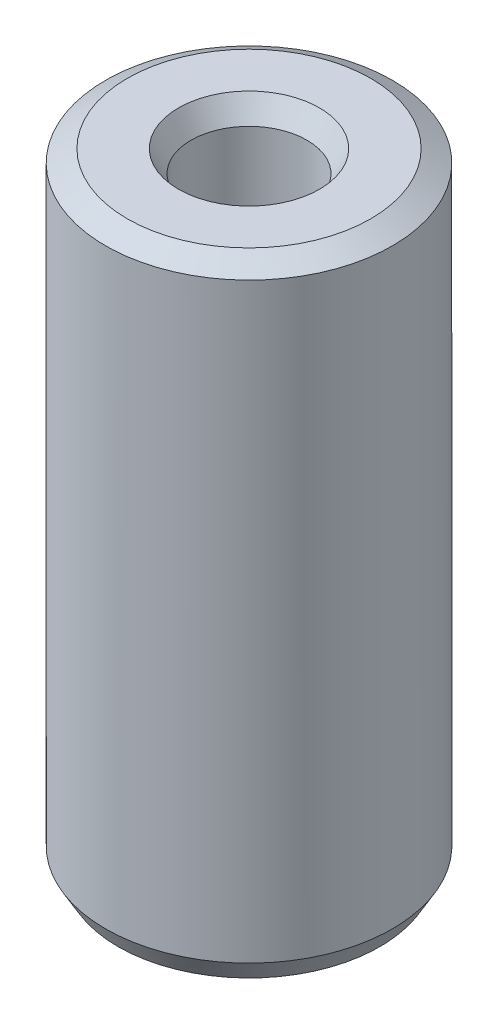
ISO-10303-21;
HEADER;
FILE_DESCRIPTION(('STEP AP214'),'2;1');
FILE_NAME('part.step','',(''),(''),'','','');
FILE_SCHEMA(('AUTOMOTIVE_DESIGN { 1 0 10303 214 1 1 1 1 }'));
ENDSEC;
DATA;
#1=APPLICATION_CONTEXT('core data for automotive mechanical design processes');
#2=APPLICATION_PROTOCOL_DEFINITION('international standard','automotive_design',2000,#1);
#3=PRODUCT_CONTEXT('',#1,'mechanical');
#4=PRODUCT('Part','Part','',(#3));
#5=PRODUCT_RELATED_PRODUCT_CATEGORY('part','',(#4));
#6=PRODUCT_DEFINITION_FORMATION('','',#4);
#7=PRODUCT_DEFINITION_CONTEXT('part definition',#1,'design');
#8=PRODUCT_DEFINITION('design','',#6,#7);
#9=PRODUCT_DEFINITION_SHAPE('','',#8);
#10=(LENGTH_UNIT() NAMED_UNIT(*) SI_UNIT(.MILLI.,.METRE.));
#11=(NAMED_UNIT(*) PLANE_ANGLE_UNIT() SI_UNIT($,.RADIAN.));
#12=(NAMED_UNIT(*) SI_UNIT($,.STERADIAN.) SOLID_ANGLE_UNIT());
#13=UNCERTAINTY_MEASURE_WITH_UNIT(LENGTH_MEASURE(1.E-05),#10,'distance_accuracy_value','');
#14=(GEOMETRIC_REPRESENTATION_CONTEXT(3) GLOBAL_UNCERTAINTY_ASSIGNED_CONTEXT((#13)) GLOBAL_UNIT_ASSIGNED_CONTEXT((#10,
#11,#12)) REPRESENTATION_CONTEXT('',''));
#15=CARTESIAN_POINT('',(0.,0.,0.));
#16=DIRECTION('',(0.,0.,1.));
#17=DIRECTION('',(1.,0.,0.));
#18=AXIS2_PLACEMENT_3D('',#15,#16,#17);
#19=CARTESIAN_POINT('',(0.,196.344045283178,0.));
#20=DIRECTION('',(0.,-1.,0.));
#21=DIRECTION('',(0.,0.,-1.));
#22=AXIS2_PLACEMENT_3D('',#19,#20,#21);
#23=CYLINDRICAL_SURFACE('',#22,45.);
#24=CARTESIAN_POINT('',(0.,6.81315488864112,0.));
#25=DIRECTION('',(0.,1.,0.));
#26=DIRECTION('',(0.,0.,1.));
#27=AXIS2_PLACEMENT_3D('',#24,#25,#26);
#28=CIRCLE('',#27,45.);
#29=CARTESIAN_POINT('',(0.,6.81315488864112,-45.));
#30=VERTEX_POINT('',#29);
#31=EDGE_CURVE('E10',#30,#30,#28,.T.);
#32=CARTESIAN_POINT('',(0.,192.410468474191,0.));
#33=DIRECTION('',(0.,1.,0.));
#34=DIRECTION('',(0.,0.,1.));
#35=AXIS2_PLACEMENT_3D('',#32,#33,#34);
#36=CIRCLE('',#35,45.);
#37=CARTESIAN_POINT('',(0.,192.410468474191,-45.));
#38=VERTEX_POINT('',#37);
#39=EDGE_CURVE('E50',#38,#38,#36,.F.);
#40=CARTESIAN_POINT('',(0.,6.81315488864112,-45.));
#41=CARTESIAN_POINT('',(0.,8.7464602384906,-45.));
#42=CARTESIAN_POINT('',(0.,10.6797655883401,-45.));
#43=CARTESIAN_POINT('',(0.,14.546376288039,-45.));
#44=CARTESIAN_POINT('',(0.,16.4796816378885,-45.));
#45=CARTESIAN_POINT('',(0.,20.3462923375875,-45.));
#46=CARTESIAN_POINT('',(0.,22.279597687437,-45.));
#47=CARTESIAN_POINT('',(0.,26.1462083871359,-45.));
#48=CARTESIAN_POINT('',(0.,28.0795137369854,-45.));
#49=CARTESIAN_POINT('',(0.,31.9461244366843,-45.));
#50=CARTESIAN_POINT('',(0.,33.8794297865338,-45.));
#51=CARTESIAN_POINT('',(0.,37.7460404862328,-45.));
#52=CARTESIAN_POINT('',(0.,39.6793458360823,-45.));
#53=CARTESIAN_POINT('',(0.,43.5459565357812,-45.));
#54=CARTESIAN_POINT('',(0.,45.4792618856307,-45.));
#55=CARTESIAN_POINT('',(0.,49.3458725853296,-45.));
#56=CARTESIAN_POINT('',(0.,51.2791779351791,-45.));
#57=CARTESIAN_POINT('',(0.,55.1457886348781,-45.));
#58=CARTESIAN_POINT('',(0.,57.0790939847275,-45.));
#59=CARTESIAN_POINT('',(0.,60.9457046844265,-45.));
#60=CARTESIAN_POINT('',(0.,62.879010034276,-45.));
#61=CARTESIAN_POINT('',(0.,66.7456207339749,-45.));
#62=CARTESIAN_POINT('',(0.,68.6789260838244,-45.));
#63=CARTESIAN_POINT('',(0.,72.5455367835234,-45.));
#64=CARTESIAN_POINT('',(0.,74.4788421333729,-45.));
#65=CARTESIAN_POINT('',(0.,78.3454528330718,-45.));
#66=CARTESIAN_POINT('',(0.,80.2787581829213,-45.));
#67=CARTESIAN_POINT('',(0.,84.1453688826202,-45.));
#68=CARTESIAN_POINT('',(0.,86.0786742324697,-45.));
#69=CARTESIAN_POINT('',(0.,89.9452849321687,-45.));
#70=CARTESIAN_POINT('',(0.,91.8785902820181,-45.));
#71=CARTESIAN_POINT('',(0.,95.7452009817171,-45.));
#72=CARTESIAN_POINT('',(0.,97.6785063315666,-45.));
#73=CARTESIAN_POINT('',(0.,101.545117031266,-45.));
#74=CARTESIAN_POINT('',(0.,103.478422381115,-45.));
#75=CARTESIAN_POINT('',(0.,107.345033080814,-45.));
#76=CARTESIAN_POINT('',(0.,109.278338430663,-45.));
#77=CARTESIAN_POINT('',(0.,113.144949130362,-45.));
#78=CARTESIAN_POINT('',(0.,115.078254480212,-45.));
#79=CARTESIAN_POINT('',(0.,118.944865179911,-45.));
#80=CARTESIAN_POINT('',(0.,120.87817052976,-45.));
#81=CARTESIAN_POINT('',(0.,124.744781229459,-45.));
#82=CARTESIAN_POINT('',(0.,126.678086579309,-45.));
#83=CARTESIAN_POINT('',(0.,130.544697279008,-45.));
#84=CARTESIAN_POINT('',(0.,132.478002628857,-45.));
#85=CARTESIAN_POINT('',(0.,136.344613328556,-45.));
#86=CARTESIAN_POINT('',(0.,138.277918678406,-45.));
#87=CARTESIAN_POINT('',(0.,142.144529378105,-45.));
#88=CARTESIAN_POINT('',(0.,144.077834727954,-45.));
#89=CARTESIAN_POINT('',(0.,147.944445427653,-45.));
#90=CARTESIAN_POINT('',(0.,149.877750777502,-45.));
#91=CARTESIAN_POINT('',(0.,153.744361477201,-45.));
#92=CARTESIAN_POINT('',(0.,155.677666827051,-45.));
#93=CARTESIAN_POINT('',(0.,159.54427752675,-45.));
#94=CARTESIAN_POINT('',(0.,161.477582876599,-45.));
#95=CARTESIAN_POINT('',(0.,165.344193576298,-45.));
#96=CARTESIAN_POINT('',(0.,167.277498926148,-45.));
#97=CARTESIAN_POINT('',(0.,171.144109625847,-45.));
#98=CARTESIAN_POINT('',(0.,173.077414975696,-45.));
#99=CARTESIAN_POINT('',(0.,176.944025675395,-45.));
#100=CARTESIAN_POINT('',(0.,178.877331025245,-45.));
#101=CARTESIAN_POINT('',(0.,182.743941724944,-45.));
#102=CARTESIAN_POINT('',(0.,184.677247074793,-45.));
#103=CARTESIAN_POINT('',(0.,188.543857774492,-45.));
#104=CARTESIAN_POINT('',(0.,190.477163124342,-45.));
#105=CARTESIAN_POINT('',(0.,192.410468474191,-45.));
#106=B_SPLINE_CURVE_WITH_KNOTS('',3,(#40,#41,#42,#43,#44,#45,#46,#47,#48,#49,#50,#51,#52,#53,
#54,#55,#56,#57,#58,#59,#60,#61,#62,#63,#64,#65,#66,#67,#68,#69,#70,#71,#72,#73,#74,#75,#76,#77,
#78,#79,#80,#81,#82,#83,#84,#85,#86,#87,#88,#89,#90,#91,#92,#93,#94,#95,#96,#97,#98,#99,#100,
#101,#102,#103,#104,#105),.UNSPECIFIED.,.F.,.F.,(4,2,2,2,2,2,2,2,2,2,2,2,2,2,2,2,2,2,2,2,2,2,2,
2,2,2,2,2,2,2,2,2,4),(0.,5.79991604954844,11.5998320990969,17.3997481486453,23.1996641981937,
28.9995802477422,34.7994962972906,40.599412346839,46.3993283963875,52.1992444459359,
57.9991604954843,63.7990765450328,69.5989925945812,75.3989086441296,81.1988246936781,
86.9987407432265,92.7986567927749,98.5985728423234,104.398488891872,110.19840494142,
115.998320990969,121.798237040517,127.598153090066,133.398069139614,139.197985189162,
144.997901238711,150.797817288259,156.597733337808,162.397649387356,168.197565436905,
173.997481486453,179.797397536001,185.59731358555),.UNSPECIFIED.);
#107=EDGE_CURVE('BSEAM39',#30,#38,#106,.T.);
#108=ORIENTED_EDGE('',*,*,#31,.T.);
#109=ORIENTED_EDGE('',*,*,#39,.T.);
#110=ORIENTED_EDGE('',*,*,#107,.T.);
#111=ORIENTED_EDGE('',*,*,#107,.F.);
#112=EDGE_LOOP('',(#108,#110,#109,#111));
#113=FACE_BOUND('',#112,.T.);
#114=ADVANCED_FACE('F39',(#113),#23,.T.);
#115=CARTESIAN_POINT('',(0.,196.344045283178,0.));
#116=DIRECTION('',(0.,1.,0.));
#117=DIRECTION('',(0.,0.,1.));
#118=AXIS2_PLACEMENT_3D('',#115,#116,#117);
#119=PLANE('',#118);
#120=CARTESIAN_POINT('',(0.,196.344045283178,0.));
#121=DIRECTION('',(0.,1.,0.));
#122=DIRECTION('',(0.,0.,1.));
#123=AXIS2_PLACEMENT_3D('',#120,#121,#122);
#124=CIRCLE('',#123,22.1260166864115);
#125=CARTESIAN_POINT('',(0.,196.344045283178,22.1260166864115));
#126=VERTEX_POINT('',#125);
#127=EDGE_CURVE('E58',#126,#126,#124,.F.);
#128=ORIENTED_EDGE('',*,*,#127,.T.);
#129=EDGE_LOOP('',(#128));
#130=FACE_BOUND('',#129,.T.);
#131=CARTESIAN_POINT('',(0.,196.344045283178,0.));
#132=DIRECTION('',(0.,1.,0.));
#133=DIRECTION('',(0.,0.,1.));
#134=AXIS2_PLACEMENT_3D('',#131,#132,#133);
#135=CIRCLE('',#134,38.1868451113594);
#136=CARTESIAN_POINT('',(0.,196.344045283178,38.1868451113594));
#137=VERTEX_POINT('',#136);
#138=EDGE_CURVE('E61',#137,#137,#135,.T.);
#139=ORIENTED_EDGE('',*,*,#138,.T.);
#140=EDGE_LOOP('',(#139));
#141=FACE_BOUND('',#140,.T.);
#142=ADVANCED_FACE('F88',(#130,#141),#119,.T.);
#143=CARTESIAN_POINT('',(0.,0.,0.));
#144=DIRECTION('',(0.,1.,0.));
#145=DIRECTION('',(0.,0.,1.));
#146=AXIS2_PLACEMENT_3D('',#143,#144,#145);
#147=PLANE('',#146);
#148=CARTESIAN_POINT('',(0.,0.,0.));
#149=DIRECTION('',(0.,1.,0.));
#150=DIRECTION('',(0.,0.,1.));
#151=AXIS2_PLACEMENT_3D('',#148,#149,#150);
#152=CIRCLE('',#151,25.0055947660646);
#153=CARTESIAN_POINT('',(0.,0.,25.0055947660646));
#154=VERTEX_POINT('',#153);
#155=EDGE_CURVE('E51',#154,#154,#152,.T.);
#156=ORIENTED_EDGE('',*,*,#155,.T.);
#157=EDGE_LOOP('',(#156));
#158=FACE_BOUND('',#157,.T.);
#159=CARTESIAN_POINT('',(0.,0.,0.));
#160=DIRECTION('',(0.,1.,0.));
#161=DIRECTION('',(0.,0.,1.));
#162=AXIS2_PLACEMENT_3D('',#159,#160,#161);
#163=CIRCLE('',#162,41.0664231910124);
#164=CARTESIAN_POINT('',(0.,0.,41.0664231910124));
#165=VERTEX_POINT('',#164);
#166=EDGE_CURVE('E54',#165,#165,#163,.F.);
#167=ORIENTED_EDGE('',*,*,#166,.T.);
#168=EDGE_LOOP('',(#167));
#169=FACE_BOUND('',#168,.T.);
#170=ADVANCED_FACE('F83',(#158,#169),#147,.F.);
#171=CARTESIAN_POINT('',(0.,196.344045283178,0.));
#172=DIRECTION('',(0.,-1.,0.));
#173=DIRECTION('',(0.,0.,-1.));
#174=AXIS2_PLACEMENT_3D('',#171,#172,#173);
#175=CYLINDRICAL_SURFACE('',#174,18.192439877424);
#176=CARTESIAN_POINT('',(0.,189.530890394537,0.));
#177=DIRECTION('',(0.,1.,0.));
#178=DIRECTION('',(0.,0.,1.));
#179=AXIS2_PLACEMENT_3D('',#176,#177,#178);
#180=CIRCLE('',#179,18.192439877424);
#181=CARTESIAN_POINT('',(0.,189.530890394537,-18.192439877424));
#182=VERTEX_POINT('',#181);
#183=EDGE_CURVE('E67',#182,#182,#180,.T.);
#184=CARTESIAN_POINT('',(0.,3.93357680898734,0.));
#185=DIRECTION('',(0.,1.,0.));
#186=DIRECTION('',(0.,0.,1.));
#187=AXIS2_PLACEMENT_3D('',#184,#185,#186);
#188=CIRCLE('',#187,18.192439877424);
#189=CARTESIAN_POINT('',(0.,3.93357680898734,-18.192439877424));
#190=VERTEX_POINT('',#189);
#191=EDGE_CURVE('E69',#190,#190,#188,.F.);
#192=CARTESIAN_POINT('',(0.,189.530890394537,-18.192439877424));
#193=CARTESIAN_POINT('',(0.,187.597585044688,-18.192439877424));
#194=CARTESIAN_POINT('',(0.,185.664279694838,-18.192439877424));
#195=CARTESIAN_POINT('',(0.,181.797668995139,-18.192439877424));
#196=CARTESIAN_POINT('',(0.,179.86436364529,-18.192439877424));
#197=CARTESIAN_POINT('',(0.,175.997752945591,-18.192439877424));
#198=CARTESIAN_POINT('',(0.,174.064447595742,-18.192439877424));
#199=CARTESIAN_POINT('',(0.,170.197836896043,-18.192439877424));
#200=CARTESIAN_POINT('',(0.,168.264531546193,-18.192439877424));
#201=CARTESIAN_POINT('',(0.,164.397920846494,-18.192439877424));
#202=CARTESIAN_POINT('',(0.,162.464615496645,-18.192439877424));
#203=CARTESIAN_POINT('',(0.,158.598004796946,-18.192439877424));
#204=CARTESIAN_POINT('',(0.,156.664699447096,-18.192439877424));
#205=CARTESIAN_POINT('',(0.,152.798088747397,-18.192439877424));
#206=CARTESIAN_POINT('',(0.,150.864783397548,-18.192439877424));
#207=CARTESIAN_POINT('',(0.,146.998172697849,-18.192439877424));
#208=CARTESIAN_POINT('',(0.,145.064867347999,-18.192439877424));
#209=CARTESIAN_POINT('',(0.,141.1982566483,-18.192439877424));
#210=CARTESIAN_POINT('',(0.,139.264951298451,-18.192439877424));
#211=CARTESIAN_POINT('',(0.,135.398340598752,-18.192439877424));
#212=CARTESIAN_POINT('',(0.,133.465035248902,-18.192439877424));
#213=CARTESIAN_POINT('',(0.,129.598424549204,-18.192439877424));
#214=CARTESIAN_POINT('',(0.,127.665119199354,-18.192439877424));
#215=CARTESIAN_POINT('',(0.,123.798508499655,-18.192439877424));
#216=CARTESIAN_POINT('',(0.,121.865203149806,-18.192439877424));
#217=CARTESIAN_POINT('',(0.,117.998592450107,-18.192439877424));
#218=CARTESIAN_POINT('',(0.,116.065287100257,-18.192439877424));
#219=CARTESIAN_POINT('',(0.,112.198676400558,-18.192439877424));
#220=CARTESIAN_POINT('',(0.,110.265371050709,-18.192439877424));
#221=CARTESIAN_POINT('',(0.,106.39876035101,-18.192439877424));
#222=CARTESIAN_POINT('',(0.,104.46545500116,-18.192439877424));
#223=CARTESIAN_POINT('',(0.,100.598844301461,-18.192439877424));
#224=CARTESIAN_POINT('',(0.,98.6655389516118,-18.192439877424));
#225=CARTESIAN_POINT('',(0.,94.7989282519129,-18.192439877424));
#226=CARTESIAN_POINT('',(0.,92.8656229020634,-18.192439877424));
#227=CARTESIAN_POINT('',(0.,88.9990122023644,-18.192439877424));
#228=CARTESIAN_POINT('',(0.,87.065706852515,-18.192439877424));
#229=CARTESIAN_POINT('',(0.,83.199096152816,-18.192439877424));
#230=CARTESIAN_POINT('',(0.,81.2657908029665,-18.192439877424));
#231=CARTESIAN_POINT('',(0.,77.3991801032676,-18.192439877424));
#232=CARTESIAN_POINT('',(0.,75.4658747534181,-18.192439877424));
#233=CARTESIAN_POINT('',(0.,71.5992640537191,-18.192439877424));
#234=CARTESIAN_POINT('',(0.,69.6659587038697,-18.192439877424));
#235=CARTESIAN_POINT('',(0.,65.7993480041707,-18.192439877424));
#236=CARTESIAN_POINT('',(0.,63.8660426543212,-18.192439877424));
#237=CARTESIAN_POINT('',(0.,59.9994319546223,-18.192439877424));
#238=CARTESIAN_POINT('',(0.,58.0661266047728,-18.192439877424));
#239=CARTESIAN_POINT('',(0.,54.1995159050738,-18.192439877424));
#240=CARTESIAN_POINT('',(0.,52.2662105552243,-18.192439877424));
#241=CARTESIAN_POINT('',(0.,48.3995998555254,-18.192439877424));
#242=CARTESIAN_POINT('',(0.,46.4662945056759,-18.192439877424));
#243=CARTESIAN_POINT('',(0.,42.5996838059769,-18.192439877424));
#244=CARTESIAN_POINT('',(0.,40.6663784561274,-18.192439877424));
#245=CARTESIAN_POINT('',(0.,36.7997677564285,-18.192439877424));
#246=CARTESIAN_POINT('',(0.,34.866462406579,-18.192439877424));
#247=CARTESIAN_POINT('',(0.,30.9998517068801,-18.192439877424));
#248=CARTESIAN_POINT('',(0.,29.0665463570306,-18.192439877424));
#249=CARTESIAN_POINT('',(0.,25.1999356573316,-18.192439877424));
#250=CARTESIAN_POINT('',(0.,23.2666303074821,-18.192439877424));
#251=CARTESIAN_POINT('',(0.,19.4000196077832,-18.192439877424));
#252=CARTESIAN_POINT('',(0.,17.4667142579337,-18.192439877424));
#253=CARTESIAN_POINT('',(0.,13.6001035582347,-18.192439877424));
#254=CARTESIAN_POINT('',(0.,11.6667982083853,-18.192439877424));
#255=CARTESIAN_POINT('',(0.,7.8001875086863,-18.192439877424));
#256=CARTESIAN_POINT('',(0.,5.86688215883682,-18.192439877424));
#257=CARTESIAN_POINT('',(0.,3.93357680898734,-18.192439877424));
#258=B_SPLINE_CURVE_WITH_KNOTS('',3,(#192,#193,#194,#195,#196,#197,#198,#199,#200,#201,#202,
#203,#204,#205,#206,#207,#208,#209,#210,#211,#212,#213,#214,#215,#216,#217,#218,#219,#220,#221,
#222,#223,#224,#225,#226,#227,#228,#229,#230,#231,#232,#233,#234,#235,#236,#237,#238,#239,#240,
#241,#242,#243,#244,#245,#246,#247,#248,#249,#250,#251,#252,#253,#254,#255,#256,#257),
.UNSPECIFIED.,.F.,.F.,(4,2,2,2,2,2,2,2,2,2,2,2,2,2,2,2,2,2,2,2,2,2,2,2,2,2,2,2,2,2,2,2,4),(0.,
5.79991604954846,11.5998320990969,17.3997481486453,23.1996641981938,28.9995802477422,
34.7994962972907,40.5994123468391,46.3993283963875,52.199244445936,57.9991604954844,
63.7990765450328,69.5989925945813,75.3989086441297,81.1988246936781,86.9987407432266,
92.798656792775,98.5985728423235,104.398488891872,110.19840494142,115.998320990969,
121.798237040517,127.598153090066,133.398069139614,139.197985189163,144.997901238711,
150.797817288259,156.597733337808,162.397649387356,168.197565436905,173.997481486453,
179.797397536002,185.59731358555),.UNSPECIFIED.);
#259=EDGE_CURVE('BSEAM71',#182,#190,#258,.T.);
#260=ORIENTED_EDGE('',*,*,#183,.T.);
#261=ORIENTED_EDGE('',*,*,#191,.T.);
#262=ORIENTED_EDGE('',*,*,#259,.T.);
#263=ORIENTED_EDGE('',*,*,#259,.F.);
#264=EDGE_LOOP('',(#260,#262,#261,#263));
#265=FACE_BOUND('',#264,.T.);
#266=ADVANCED_FACE('F71',(#265),#175,.F.);
#267=CARTESIAN_POINT('',(0.,189.530890394537,0.));
#268=DIRECTION('',(0.,1.,0.));
#269=DIRECTION('',(0.,0.,1.));
#270=AXIS2_PLACEMENT_3D('',#267,#268,#269);
#271=CONICAL_SURFACE('',#270,18.192439877424,0.5235987755983);
#272=ORIENTED_EDGE('',*,*,#127,.F.);
#273=EDGE_LOOP('',(#272));
#274=FACE_BOUND('',#273,.T.);
#275=ORIENTED_EDGE('',*,*,#183,.F.);
#276=EDGE_LOOP('',(#275));
#277=FACE_BOUND('',#276,.T.);
#278=ADVANCED_FACE('F77',(#274,#277),#271,.F.);
#279=CARTESIAN_POINT('',(0.,0.,0.));
#280=DIRECTION('',(0.,-1.,0.));
#281=DIRECTION('',(0.,0.,-1.));
#282=AXIS2_PLACEMENT_3D('',#279,#280,#281);
#283=CONICAL_SURFACE('',#282,25.0055947660646,1.04719755119659);
#284=ORIENTED_EDGE('',*,*,#191,.F.);
#285=EDGE_LOOP('',(#284));
#286=FACE_BOUND('',#285,.T.);
#287=ORIENTED_EDGE('',*,*,#155,.F.);
#288=EDGE_LOOP('',(#287));
#289=FACE_BOUND('',#288,.T.);
#290=ADVANCED_FACE('F73',(#286,#289),#283,.F.);
#291=CARTESIAN_POINT('',(0.,6.81315488864112,0.));
#292=DIRECTION('',(0.,1.,0.));
#293=DIRECTION('',(0.,0.,1.));
#294=AXIS2_PLACEMENT_3D('',#291,#292,#293);
#295=CONICAL_SURFACE('',#294,45.,0.523598775598303);
#296=ORIENTED_EDGE('',*,*,#166,.F.);
#297=EDGE_LOOP('',(#296));
#298=FACE_BOUND('',#297,.T.);
#299=ORIENTED_EDGE('',*,*,#31,.F.);
#300=EDGE_LOOP('',(#299));
#301=FACE_BOUND('',#300,.T.);
#302=ADVANCED_FACE('F76',(#298,#301),#295,.T.);
#303=CARTESIAN_POINT('',(0.,196.344045283178,0.));
#304=DIRECTION('',(0.,-1.,0.));
#305=DIRECTION('',(0.,0.,-1.));
#306=AXIS2_PLACEMENT_3D('',#303,#304,#305);
#307=CONICAL_SURFACE('',#306,38.1868451113594,1.04719755119659);
#308=ORIENTED_EDGE('',*,*,#39,.F.);
#309=EDGE_LOOP('',(#308));
#310=FACE_BOUND('',#309,.T.);
#311=ORIENTED_EDGE('',*,*,#138,.F.);
#312=EDGE_LOOP('',(#311));
#313=FACE_BOUND('',#312,.T.);
#314=ADVANCED_FACE('F45',(#310,#313),#307,.T.);
#315=CLOSED_SHELL('',(#114,#142,#170,#266,#278,#290,#302,#314));
#316=MANIFOLD_SOLID_BREP('B2',#315);
#317=ADVANCED_BREP_SHAPE_REPRESENTATION('',(#18,#316),#14);
#318=SHAPE_DEFINITION_REPRESENTATION(#9,#317);
ENDSEC;
END-ISO-10303-21;
